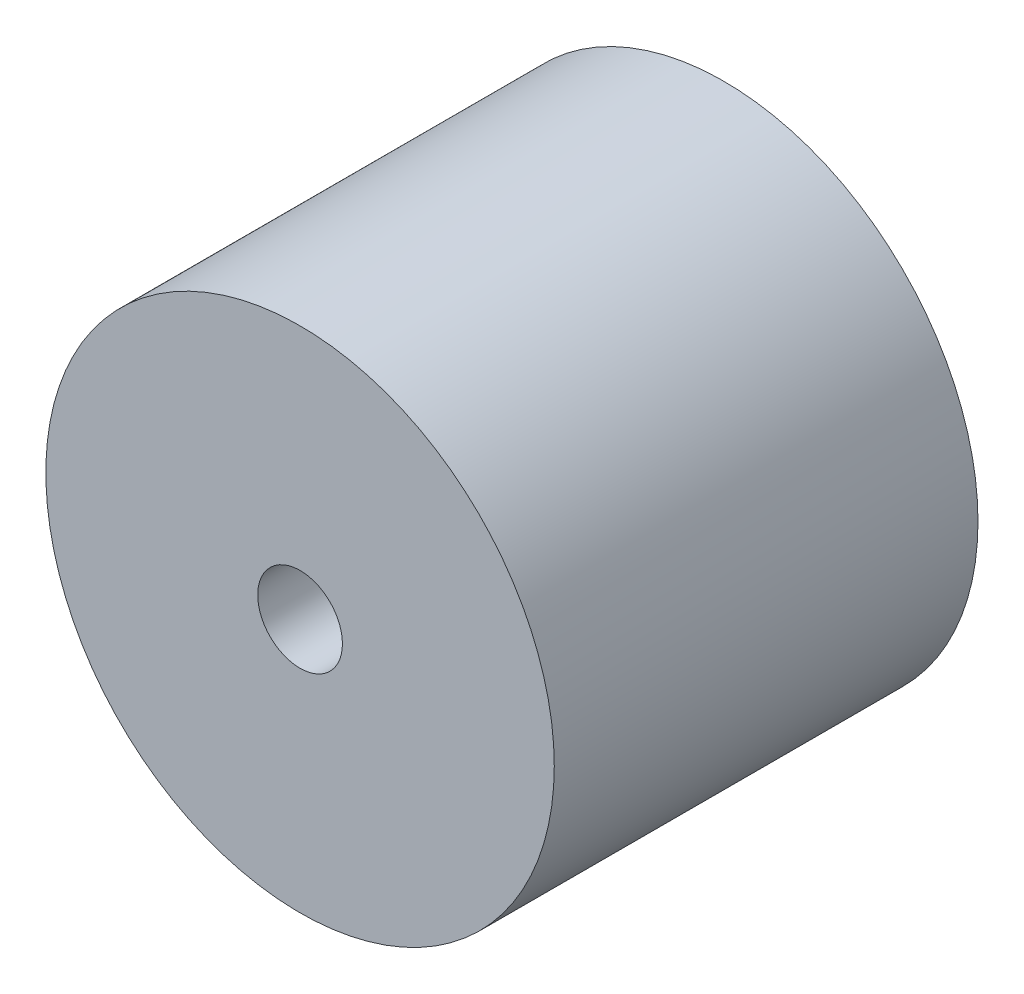
ISO-10303-21;
HEADER;
FILE_DESCRIPTION(('STEP AP214'),'2;1');
FILE_NAME('part.step','',(''),(''),'','','');
FILE_SCHEMA(('AUTOMOTIVE_DESIGN { 1 0 10303 214 1 1 1 1 }'));
ENDSEC;
DATA;
#1=APPLICATION_CONTEXT('core data for automotive mechanical design processes');
#2=APPLICATION_PROTOCOL_DEFINITION('international standard','automotive_design',2000,#1);
#3=PRODUCT_CONTEXT('',#1,'mechanical');
#4=PRODUCT('Part','Part','',(#3));
#5=PRODUCT_RELATED_PRODUCT_CATEGORY('part','',(#4));
#6=PRODUCT_DEFINITION_FORMATION('','',#4);
#7=PRODUCT_DEFINITION_CONTEXT('part definition',#1,'design');
#8=PRODUCT_DEFINITION('design','',#6,#7);
#9=PRODUCT_DEFINITION_SHAPE('','',#8);
#10=(LENGTH_UNIT() NAMED_UNIT(*) SI_UNIT(.MILLI.,.METRE.));
#11=(NAMED_UNIT(*) PLANE_ANGLE_UNIT() SI_UNIT($,.RADIAN.));
#12=(NAMED_UNIT(*) SI_UNIT($,.STERADIAN.) SOLID_ANGLE_UNIT());
#13=UNCERTAINTY_MEASURE_WITH_UNIT(LENGTH_MEASURE(1.E-05),#10,'distance_accuracy_value','');
#14=(GEOMETRIC_REPRESENTATION_CONTEXT(3) GLOBAL_UNCERTAINTY_ASSIGNED_CONTEXT((#13)) GLOBAL_UNIT_ASSIGNED_CONTEXT((#10,
#11,#12)) REPRESENTATION_CONTEXT('',''));
#15=CARTESIAN_POINT('',(0.,0.,0.));
#16=DIRECTION('',(0.,0.,1.));
#17=DIRECTION('',(1.,0.,0.));
#18=AXIS2_PLACEMENT_3D('',#15,#16,#17);
#19=CARTESIAN_POINT('',(0.,0.,30.));
#20=DIRECTION('',(0.,0.,1.));
#21=DIRECTION('',(1.,0.,0.));
#22=AXIS2_PLACEMENT_3D('',#19,#20,#21);
#23=PLANE('',#22);
#24=CARTESIAN_POINT('',(0.,0.,30.));
#25=DIRECTION('',(0.,0.,1.));
#26=DIRECTION('',(1.,0.,0.));
#27=AXIS2_PLACEMENT_3D('',#24,#25,#26);
#28=CIRCLE('',#27,18.);
#29=CARTESIAN_POINT('',(18.,0.,30.));
#30=VERTEX_POINT('',#29);
#31=EDGE_CURVE('E10',#30,#30,#28,.T.);
#32=ORIENTED_EDGE('',*,*,#31,.T.);
#33=EDGE_LOOP('',(#32));
#34=FACE_BOUND('',#33,.T.);
#35=CARTESIAN_POINT('',(0.,0.,30.));
#36=DIRECTION('',(0.,0.,1.));
#37=DIRECTION('',(1.,0.,0.));
#38=AXIS2_PLACEMENT_3D('',#35,#36,#37);
#39=CIRCLE('',#38,3.);
#40=CARTESIAN_POINT('',(3.,0.,30.));
#41=VERTEX_POINT('',#40);
#42=EDGE_CURVE('E50',#41,#41,#39,.T.);
#43=ORIENTED_EDGE('',*,*,#42,.F.);
#44=EDGE_LOOP('',(#43));
#45=FACE_BOUND('',#44,.T.);
#46=ADVANCED_FACE('F37',(#34,#45),#23,.T.);
#47=CARTESIAN_POINT('',(0.,0.,0.));
#48=DIRECTION('',(0.,0.,1.));
#49=DIRECTION('',(1.,0.,0.));
#50=AXIS2_PLACEMENT_3D('',#47,#48,#49);
#51=PLANE('',#50);
#52=CARTESIAN_POINT('',(0.,0.,0.));
#53=DIRECTION('',(0.,0.,1.));
#54=DIRECTION('',(1.,0.,0.));
#55=AXIS2_PLACEMENT_3D('',#52,#53,#54);
#56=CIRCLE('',#55,18.);
#57=CARTESIAN_POINT('',(18.,0.,0.));
#58=VERTEX_POINT('',#57);
#59=EDGE_CURVE('E41',#58,#58,#56,.T.);
#60=ORIENTED_EDGE('',*,*,#59,.F.);
#61=EDGE_LOOP('',(#60));
#62=FACE_BOUND('',#61,.T.);
#63=CARTESIAN_POINT('',(0.,0.,0.));
#64=DIRECTION('',(0.,0.,1.));
#65=DIRECTION('',(1.,0.,0.));
#66=AXIS2_PLACEMENT_3D('',#63,#64,#65);
#67=CIRCLE('',#66,3.);
#68=CARTESIAN_POINT('',(3.,0.,0.));
#69=VERTEX_POINT('',#68);
#70=EDGE_CURVE('E52',#69,#69,#67,.T.);
#71=ORIENTED_EDGE('',*,*,#70,.T.);
#72=EDGE_LOOP('',(#71));
#73=FACE_BOUND('',#72,.T.);
#74=ADVANCED_FACE('F64',(#62,#73),#51,.F.);
#75=CARTESIAN_POINT('',(0.,0.,30.));
#76=DIRECTION('',(0.,0.,-1.));
#77=DIRECTION('',(-1.,0.,0.));
#78=AXIS2_PLACEMENT_3D('',#75,#76,#77);
#79=CYLINDRICAL_SURFACE('',#78,18.);
#80=ORIENTED_EDGE('',*,*,#31,.F.);
#81=EDGE_LOOP('',(#80));
#82=FACE_BOUND('',#81,.T.);
#83=ORIENTED_EDGE('',*,*,#59,.T.);
#84=EDGE_LOOP('',(#83));
#85=FACE_BOUND('',#84,.T.);
#86=ADVANCED_FACE('F39',(#82,#85),#79,.T.);
#87=CARTESIAN_POINT('',(0.,0.,30.));
#88=DIRECTION('',(0.,0.,-1.));
#89=DIRECTION('',(-1.,0.,0.));
#90=AXIS2_PLACEMENT_3D('',#87,#88,#89);
#91=CYLINDRICAL_SURFACE('',#90,3.);
#92=ORIENTED_EDGE('',*,*,#42,.T.);
#93=EDGE_LOOP('',(#92));
#94=FACE_BOUND('',#93,.T.);
#95=ORIENTED_EDGE('',*,*,#70,.F.);
#96=EDGE_LOOP('',(#95));
#97=FACE_BOUND('',#96,.T.);
#98=ADVANCED_FACE('F60',(#94,#97),#91,.F.);
#99=CLOSED_SHELL('',(#46,#74,#86,#98));
#100=MANIFOLD_SOLID_BREP('B2',#99);
#101=ADVANCED_BREP_SHAPE_REPRESENTATION('',(#18,#100),#14);
#102=SHAPE_DEFINITION_REPRESENTATION(#9,#101);
ENDSEC;
END-ISO-10303-21;
